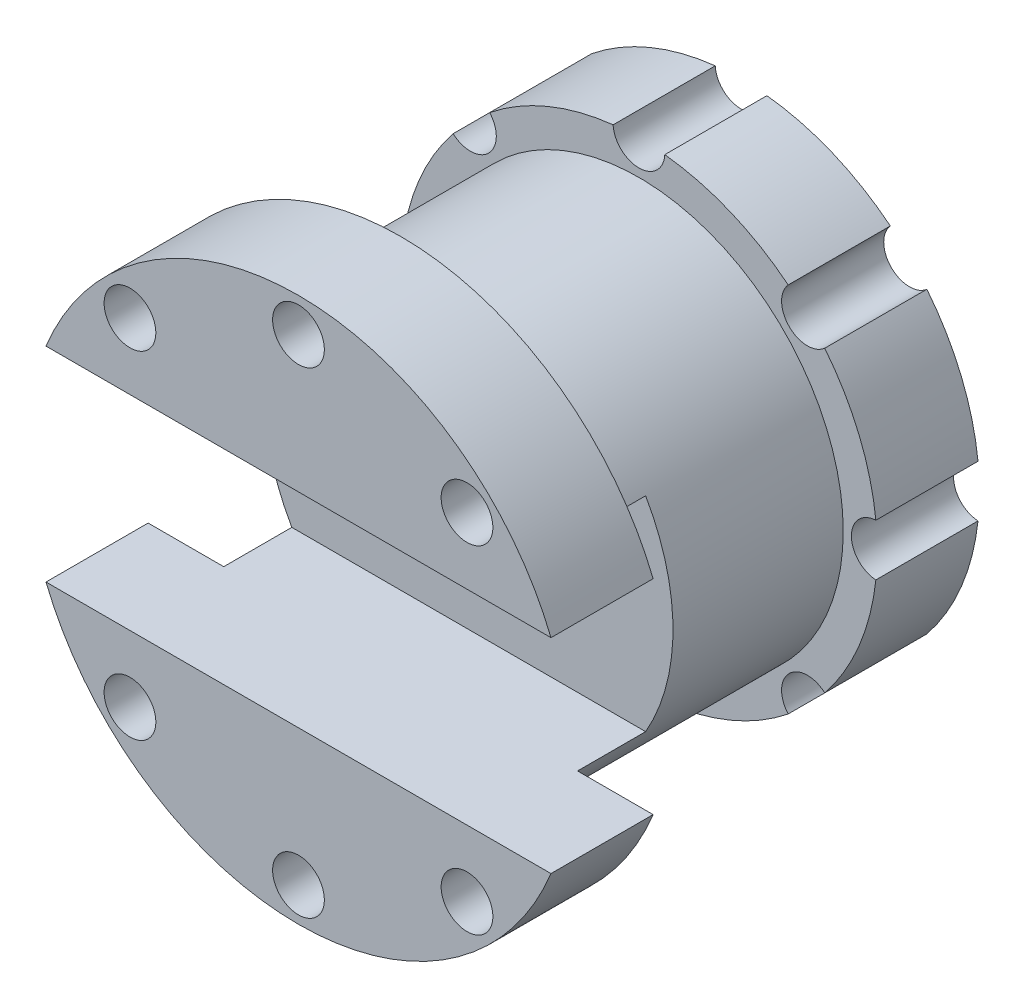
ISO-10303-21;
HEADER;
FILE_DESCRIPTION(('STEP AP214'),'2;1');
FILE_NAME('part.step','',(''),(''),'','','');
FILE_SCHEMA(('AUTOMOTIVE_DESIGN { 1 0 10303 214 1 1 1 1 }'));
ENDSEC;
DATA;
#1=APPLICATION_CONTEXT('core data for automotive mechanical design processes');
#2=APPLICATION_PROTOCOL_DEFINITION('international standard','automotive_design',2000,#1);
#3=PRODUCT_CONTEXT('',#1,'mechanical');
#4=PRODUCT('Part','Part','',(#3));
#5=PRODUCT_RELATED_PRODUCT_CATEGORY('part','',(#4));
#6=PRODUCT_DEFINITION_FORMATION('','',#4);
#7=PRODUCT_DEFINITION_CONTEXT('part definition',#1,'design');
#8=PRODUCT_DEFINITION('design','',#6,#7);
#9=PRODUCT_DEFINITION_SHAPE('','',#8);
#10=(LENGTH_UNIT() NAMED_UNIT(*) SI_UNIT(.MILLI.,.METRE.));
#11=(NAMED_UNIT(*) PLANE_ANGLE_UNIT() SI_UNIT($,.RADIAN.));
#12=(NAMED_UNIT(*) SI_UNIT($,.STERADIAN.) SOLID_ANGLE_UNIT());
#13=UNCERTAINTY_MEASURE_WITH_UNIT(LENGTH_MEASURE(1.E-05),#10,'distance_accuracy_value','');
#14=(GEOMETRIC_REPRESENTATION_CONTEXT(3) GLOBAL_UNCERTAINTY_ASSIGNED_CONTEXT((#13)) GLOBAL_UNIT_ASSIGNED_CONTEXT((#10,
#11,#12)) REPRESENTATION_CONTEXT('',''));
#15=CARTESIAN_POINT('',(0.,0.,0.));
#16=DIRECTION('',(0.,0.,1.));
#17=DIRECTION('',(1.,0.,0.));
#18=AXIS2_PLACEMENT_3D('',#15,#16,#17);
#19=CARTESIAN_POINT('',(0.,0.,63.5));
#20=DIRECTION('',(0.,0.,-1.));
#21=DIRECTION('',(-1.,0.,0.));
#22=AXIS2_PLACEMENT_3D('',#19,#20,#21);
#23=CYLINDRICAL_SURFACE('',#22,12.7);
#24=CARTESIAN_POINT('',(0.,0.,0.));
#25=DIRECTION('',(0.,0.,1.));
#26=DIRECTION('',(1.,0.,0.));
#27=AXIS2_PLACEMENT_3D('',#24,#25,#26);
#28=CIRCLE('',#27,12.7);
#29=CARTESIAN_POINT('',(12.7,0.,0.));
#30=VERTEX_POINT('',#29);
#31=EDGE_CURVE('E45',#30,#30,#28,.T.);
#32=ORIENTED_EDGE('',*,*,#31,.F.);
#33=EDGE_LOOP('',(#32));
#34=FACE_BOUND('',#33,.T.);
#35=CARTESIAN_POINT('',(0.,0.,50.8));
#36=DIRECTION('',(0.,0.,1.));
#37=DIRECTION('',(1.,0.,0.));
#38=AXIS2_PLACEMENT_3D('',#35,#36,#37);
#39=CIRCLE('',#38,12.7);
#40=CARTESIAN_POINT('',(12.7,0.,50.8));
#41=VERTEX_POINT('',#40);
#42=EDGE_CURVE('E498',#41,#41,#39,.F.);
#43=ORIENTED_EDGE('',*,*,#42,.F.);
#44=EDGE_LOOP('',(#43));
#45=FACE_BOUND('',#44,.T.);
#46=ADVANCED_FACE('F42',(#34,#45),#23,.F.);
#47=CARTESIAN_POINT('',(0.,0.,63.5));
#48=DIRECTION('',(0.,0.,-1.));
#49=DIRECTION('',(-1.,0.,0.));
#50=AXIS2_PLACEMENT_3D('',#47,#48,#49);
#51=CYLINDRICAL_SURFACE('',#50,38.1);
#52=CARTESIAN_POINT('',(0.,0.,19.05));
#53=DIRECTION('',(0.,0.,1.));
#54=DIRECTION('',(1.,0.,0.));
#55=AXIS2_PLACEMENT_3D('',#52,#53,#54);
#56=CIRCLE('',#55,38.1);
#57=CARTESIAN_POINT('',(38.1,0.,19.05));
#58=VERTEX_POINT('',#57);
#59=EDGE_CURVE('E194',#58,#58,#56,.T.);
#60=ORIENTED_EDGE('',*,*,#59,.T.);
#61=EDGE_LOOP('',(#60));
#62=FACE_BOUND('',#61,.T.);
#63=DIRECTION('',(0.,0.,1.));
#64=VECTOR('',#63,1.);
#65=CARTESIAN_POINT('',(-32.9955678841871,19.05,50.8));
#66=LINE('',#65,#64);
#67=CARTESIAN_POINT('',(-32.9955678841871,19.05,50.8));
#68=VERTEX_POINT('',#67);
#69=CARTESIAN_POINT('',(-32.9955678841871,19.05,63.5));
#70=VERTEX_POINT('',#69);
#71=EDGE_CURVE('E516',#68,#70,#66,.T.);
#72=ORIENTED_EDGE('',*,*,#71,.T.);
#73=CARTESIAN_POINT('',(0.,0.,63.5));
#74=DIRECTION('',(0.,0.,1.));
#75=DIRECTION('',(1.,0.,0.));
#76=AXIS2_PLACEMENT_3D('',#73,#74,#75);
#77=CIRCLE('',#76,38.1);
#78=CARTESIAN_POINT('',(32.9955678841871,19.05,63.5));
#79=VERTEX_POINT('',#78);
#80=EDGE_CURVE('E12',#79,#70,#77,.T.);
#81=ORIENTED_EDGE('',*,*,#80,.F.);
#82=DIRECTION('',(0.,0.,1.));
#83=VECTOR('',#82,1.);
#84=CARTESIAN_POINT('',(32.9955678841871,19.05,50.8));
#85=LINE('',#84,#83);
#86=CARTESIAN_POINT('',(32.9955678841871,19.05,50.8));
#87=VERTEX_POINT('',#86);
#88=EDGE_CURVE('E521',#87,#79,#85,.T.);
#89=ORIENTED_EDGE('',*,*,#88,.F.);
#90=CARTESIAN_POINT('',(0.,0.,50.8));
#91=DIRECTION('',(0.,0.,1.));
#92=DIRECTION('',(1.,0.,0.));
#93=AXIS2_PLACEMENT_3D('',#90,#91,#92);
#94=CIRCLE('',#93,38.1);
#95=CARTESIAN_POINT('',(32.9955678841871,-19.05,50.8));
#96=VERTEX_POINT('',#95);
#97=EDGE_CURVE('E507',#96,#87,#94,.T.);
#98=ORIENTED_EDGE('',*,*,#97,.F.);
#99=DIRECTION('',(0.,0.,1.));
#100=VECTOR('',#99,1.);
#101=CARTESIAN_POINT('',(32.9955678841871,-19.05,50.8));
#102=LINE('',#101,#100);
#103=CARTESIAN_POINT('',(32.9955678841871,-19.05,63.5));
#104=VERTEX_POINT('',#103);
#105=EDGE_CURVE('E316',#96,#104,#102,.T.);
#106=ORIENTED_EDGE('',*,*,#105,.T.);
#107=CARTESIAN_POINT('',(-32.9955678841871,-19.05,63.5));
#108=VERTEX_POINT('',#107);
#109=EDGE_CURVE('E52',#108,#104,#77,.T.);
#110=ORIENTED_EDGE('',*,*,#109,.F.);
#111=DIRECTION('',(0.,0.,1.));
#112=VECTOR('',#111,1.);
#113=CARTESIAN_POINT('',(-32.9955678841871,-19.05,50.8));
#114=LINE('',#113,#112);
#115=CARTESIAN_POINT('',(-32.9955678841871,-19.05,50.8));
#116=VERTEX_POINT('',#115);
#117=EDGE_CURVE('E515',#116,#108,#114,.T.);
#118=ORIENTED_EDGE('',*,*,#117,.F.);
#119=EDGE_CURVE('E501',#68,#116,#94,.T.);
#120=ORIENTED_EDGE('',*,*,#119,.F.);
#121=EDGE_LOOP('',(#72,#81,#89,#98,#106,#110,#118,#120));
#122=FACE_BOUND('',#121,.T.);
#123=ADVANCED_FACE('F486',(#62,#122),#51,.T.);
#124=CARTESIAN_POINT('',(0.,0.,0.));
#125=DIRECTION('',(0.,0.,1.));
#126=DIRECTION('',(1.,0.,0.));
#127=AXIS2_PLACEMENT_3D('',#124,#125,#126);
#128=PLANE('',#127);
#129=ORIENTED_EDGE('',*,*,#31,.T.);
#130=EDGE_LOOP('',(#129));
#131=FACE_BOUND('',#130,.T.);
#132=CARTESIAN_POINT('',(-31.4308964237409,31.4308964237394,0.));
#133=DIRECTION('',(0.,0.,1.));
#134=DIRECTION('',(1.,0.,0.));
#135=AXIS2_PLACEMENT_3D('',#132,#133,#134);
#136=CIRCLE('',#135,4.82600000000236);
#137=CARTESIAN_POINT('',(-34.6531119746391,27.8381811631637,0.));
#138=VERTEX_POINT('',#137);
#139=CARTESIAN_POINT('',(-27.8381811631655,34.6531119746377,0.));
#140=VERTEX_POINT('',#139);
#141=EDGE_CURVE('E202',#138,#140,#136,.T.);
#142=ORIENTED_EDGE('',*,*,#141,.T.);
#143=CARTESIAN_POINT('',(0.,0.,0.));
#144=DIRECTION('',(0.,0.,1.));
#145=DIRECTION('',(1.,0.,0.));
#146=AXIS2_PLACEMENT_3D('',#143,#144,#145);
#147=CIRCLE('',#146,44.45);
#148=CARTESIAN_POINT('',(-4.81888379010777,44.1880171428571,0.));
#149=VERTEX_POINT('',#148);
#150=EDGE_CURVE('E212',#149,#140,#147,.T.);
#151=ORIENTED_EDGE('',*,*,#150,.F.);
#152=CARTESIAN_POINT('',(0.,44.45,0.));
#153=DIRECTION('',(0.,0.,1.));
#154=DIRECTION('',(1.,0.,0.));
#155=AXIS2_PLACEMENT_3D('',#152,#153,#154);
#156=CIRCLE('',#155,4.826);
#157=CARTESIAN_POINT('',(4.81888379010777,44.1880171428571,0.));
#158=VERTEX_POINT('',#157);
#159=EDGE_CURVE('E241',#149,#158,#156,.T.);
#160=ORIENTED_EDGE('',*,*,#159,.T.);
#161=CARTESIAN_POINT('',(27.8381811631656,34.6531119746376,0.));
#162=VERTEX_POINT('',#161);
#163=EDGE_CURVE('E183',#162,#158,#147,.T.);
#164=ORIENTED_EDGE('',*,*,#163,.F.);
#165=CARTESIAN_POINT('',(31.4308964237431,31.4308964237447,0.));
#166=DIRECTION('',(0.,0.,1.));
#167=DIRECTION('',(1.,0.,0.));
#168=AXIS2_PLACEMENT_3D('',#165,#166,#167);
#169=CIRCLE('',#168,4.82600000000035);
#170=CARTESIAN_POINT('',(34.6531119746362,27.8381811631673,0.));
#171=VERTEX_POINT('',#170);
#172=EDGE_CURVE('E237',#162,#171,#169,.T.);
#173=ORIENTED_EDGE('',*,*,#172,.T.);
#174=CARTESIAN_POINT('',(44.1880171428565,4.81888379011393,0.));
#175=VERTEX_POINT('',#174);
#176=EDGE_CURVE('E236',#175,#171,#147,.T.);
#177=ORIENTED_EDGE('',*,*,#176,.F.);
#178=CARTESIAN_POINT('',(44.4500000000038,3.78186962001106E-12,0.));
#179=DIRECTION('',(0.,0.,1.));
#180=DIRECTION('',(1.,0.,0.));
#181=AXIS2_PLACEMENT_3D('',#178,#179,#180);
#182=CIRCLE('',#181,4.82600000000266);
#183=CARTESIAN_POINT('',(44.1880171428573,-4.81888379010641,0.));
#184=VERTEX_POINT('',#183);
#185=EDGE_CURVE('E232',#175,#184,#182,.T.);
#186=ORIENTED_EDGE('',*,*,#185,.T.);
#187=CARTESIAN_POINT('',(34.6531119746443,-27.8381811631572,0.));
#188=VERTEX_POINT('',#187);
#189=EDGE_CURVE('E231',#188,#184,#147,.T.);
#190=ORIENTED_EDGE('',*,*,#189,.F.);
#191=CARTESIAN_POINT('',(31.4308964237485,-31.4308964237394,0.));
#192=DIRECTION('',(0.,0.,1.));
#193=DIRECTION('',(1.,0.,0.));
#194=AXIS2_PLACEMENT_3D('',#191,#192,#193);
#195=CIRCLE('',#194,4.82600000000561);
#196=CARTESIAN_POINT('',(27.8381811631673,-34.6531119746362,0.));
#197=VERTEX_POINT('',#196);
#198=EDGE_CURVE('E227',#188,#197,#195,.T.);
#199=ORIENTED_EDGE('',*,*,#198,.T.);
#200=CARTESIAN_POINT('',(4.8188837901228,-44.1880171428555,0.));
#201=VERTEX_POINT('',#200);
#202=EDGE_CURVE('E226',#201,#197,#147,.T.);
#203=ORIENTED_EDGE('',*,*,#202,.F.);
#204=CARTESIAN_POINT('',(7.56373924002212E-12,-44.45,0.));
#205=DIRECTION('',(0.,0.,1.));
#206=DIRECTION('',(1.,0.,0.));
#207=AXIS2_PLACEMENT_3D('',#204,#205,#206);
#208=CIRCLE('',#207,4.82600000000753);
#209=CARTESIAN_POINT('',(-4.81888379010776,-44.1880171428571,0.));
#210=VERTEX_POINT('',#209);
#211=EDGE_CURVE('E222',#201,#210,#208,.T.);
#212=ORIENTED_EDGE('',*,*,#211,.T.);
#213=CARTESIAN_POINT('',(-27.8381811631557,-34.6531119746455,0.));
#214=VERTEX_POINT('',#213);
#215=EDGE_CURVE('E221',#214,#210,#147,.T.);
#216=ORIENTED_EDGE('',*,*,#215,.F.);
#217=CARTESIAN_POINT('',(-31.4308964237356,-31.4308964237447,0.));
#218=DIRECTION('',(0.,0.,1.));
#219=DIRECTION('',(1.,0.,0.));
#220=AXIS2_PLACEMENT_3D('',#217,#218,#219);
#221=CIRCLE('',#220,4.82600000000732);
#222=CARTESIAN_POINT('',(-34.6531119746374,-27.8381811631658,0.));
#223=VERTEX_POINT('',#222);
#224=EDGE_CURVE('E217',#214,#223,#221,.T.);
#225=ORIENTED_EDGE('',*,*,#224,.T.);
#226=CARTESIAN_POINT('',(-44.1880171428561,-4.81888379011688,0.));
#227=VERTEX_POINT('',#226);
#228=EDGE_CURVE('E213',#227,#223,#147,.T.);
#229=ORIENTED_EDGE('',*,*,#228,.F.);
#230=CARTESIAN_POINT('',(-44.4499999999962,-3.78731317503327E-12,0.));
#231=DIRECTION('',(0.,0.,1.));
#232=DIRECTION('',(1.,0.,0.));
#233=AXIS2_PLACEMENT_3D('',#230,#231,#232);
#234=CIRCLE('',#233,4.82600000000517);
#235=CARTESIAN_POINT('',(-44.188017142857,4.81888379010936,0.));
#236=VERTEX_POINT('',#235);
#237=EDGE_CURVE('E211',#227,#236,#234,.T.);
#238=ORIENTED_EDGE('',*,*,#237,.T.);
#239=EDGE_CURVE('E206',#138,#236,#147,.T.);
#240=ORIENTED_EDGE('',*,*,#239,.F.);
#241=EDGE_LOOP('',(#142,#151,#160,#164,#173,#177,#186,#190,#199,#203,#212,#216,#225,#229,#238,#240));
#242=FACE_BOUND('',#241,.T.);
#243=ADVANCED_FACE('F466',(#131,#242),#128,.F.);
#244=CARTESIAN_POINT('',(-31.4308964237409,31.4308964237394,19.05));
#245=DIRECTION('',(0.,0.,-1.));
#246=DIRECTION('',(-1.,0.,0.));
#247=AXIS2_PLACEMENT_3D('',#244,#245,#246);
#248=CYLINDRICAL_SURFACE('',#247,4.82600000000236);
#249=ORIENTED_EDGE('',*,*,#141,.F.);
#250=DIRECTION('',(0.,0.,-1.));
#251=VECTOR('',#250,1.);
#252=CARTESIAN_POINT('',(-34.6531119746391,27.8381811631637,19.05));
#253=LINE('',#252,#251);
#254=CARTESIAN_POINT('',(-34.6531119746391,27.8381811631637,19.05));
#255=VERTEX_POINT('',#254);
#256=EDGE_CURVE('E124',#255,#138,#253,.T.);
#257=ORIENTED_EDGE('',*,*,#256,.F.);
#258=CARTESIAN_POINT('',(-31.4308964237409,31.4308964237394,19.05));
#259=DIRECTION('',(0.,0.,1.));
#260=DIRECTION('',(1.,0.,0.));
#261=AXIS2_PLACEMENT_3D('',#258,#259,#260);
#262=CIRCLE('',#261,4.82600000000236);
#263=CARTESIAN_POINT('',(-27.8381811631655,34.6531119746377,19.05));
#264=VERTEX_POINT('',#263);
#265=EDGE_CURVE('E391',#255,#264,#262,.T.);
#266=ORIENTED_EDGE('',*,*,#265,.T.);
#267=DIRECTION('',(0.,0.,-1.));
#268=VECTOR('',#267,1.);
#269=CARTESIAN_POINT('',(-27.8381811631655,34.6531119746377,19.05));
#270=LINE('',#269,#268);
#271=EDGE_CURVE('E120',#264,#140,#270,.T.);
#272=ORIENTED_EDGE('',*,*,#271,.T.);
#273=EDGE_LOOP('',(#249,#257,#266,#272));
#274=FACE_BOUND('',#273,.T.);
#275=ADVANCED_FACE('F476',(#274),#248,.F.);
#276=CARTESIAN_POINT('',(0.,0.,19.05));
#277=DIRECTION('',(0.,0.,-1.));
#278=DIRECTION('',(-1.,0.,0.));
#279=AXIS2_PLACEMENT_3D('',#276,#277,#278);
#280=CYLINDRICAL_SURFACE('',#279,44.45);
#281=ORIENTED_EDGE('',*,*,#239,.T.);
#282=DIRECTION('',(0.,0.,-1.));
#283=VECTOR('',#282,1.);
#284=CARTESIAN_POINT('',(-44.188017142857,4.81888379010936,19.05));
#285=LINE('',#284,#283);
#286=CARTESIAN_POINT('',(-44.188017142857,4.81888379010936,19.05));
#287=VERTEX_POINT('',#286);
#288=EDGE_CURVE('E280',#287,#236,#285,.T.);
#289=ORIENTED_EDGE('',*,*,#288,.F.);
#290=CARTESIAN_POINT('',(0.,0.,19.05));
#291=DIRECTION('',(0.,0.,1.));
#292=DIRECTION('',(1.,0.,0.));
#293=AXIS2_PLACEMENT_3D('',#290,#291,#292);
#294=CIRCLE('',#293,44.45);
#295=EDGE_CURVE('E195',#255,#287,#294,.T.);
#296=ORIENTED_EDGE('',*,*,#295,.F.);
#297=ORIENTED_EDGE('',*,*,#256,.T.);
#298=EDGE_LOOP('',(#281,#289,#296,#297));
#299=FACE_BOUND('',#298,.T.);
#300=ADVANCED_FACE('F478',(#299),#280,.T.);
#301=CARTESIAN_POINT('',(-44.4499999999962,-3.78731317503327E-12,19.05));
#302=DIRECTION('',(0.,0.,-1.));
#303=DIRECTION('',(-1.,0.,0.));
#304=AXIS2_PLACEMENT_3D('',#301,#302,#303);
#305=CYLINDRICAL_SURFACE('',#304,4.82600000000517);
#306=ORIENTED_EDGE('',*,*,#237,.F.);
#307=DIRECTION('',(0.,0.,-1.));
#308=VECTOR('',#307,1.);
#309=CARTESIAN_POINT('',(-44.1880171428561,-4.81888379011688,19.05));
#310=LINE('',#309,#308);
#311=CARTESIAN_POINT('',(-44.1880171428561,-4.81888379011688,19.05));
#312=VERTEX_POINT('',#311);
#313=EDGE_CURVE('E277',#312,#227,#310,.T.);
#314=ORIENTED_EDGE('',*,*,#313,.F.);
#315=CARTESIAN_POINT('',(-44.4499999999962,-3.78731317503327E-12,19.05));
#316=DIRECTION('',(0.,0.,1.));
#317=DIRECTION('',(1.,0.,0.));
#318=AXIS2_PLACEMENT_3D('',#315,#316,#317);
#319=CIRCLE('',#318,4.82600000000517);
#320=EDGE_CURVE('E395',#312,#287,#319,.T.);
#321=ORIENTED_EDGE('',*,*,#320,.T.);
#322=ORIENTED_EDGE('',*,*,#288,.T.);
#323=EDGE_LOOP('',(#306,#314,#321,#322));
#324=FACE_BOUND('',#323,.T.);
#325=ADVANCED_FACE('F484',(#324),#305,.F.);
#326=ORIENTED_EDGE('',*,*,#228,.T.);
#327=DIRECTION('',(0.,0.,-1.));
#328=VECTOR('',#327,1.);
#329=CARTESIAN_POINT('',(-34.6531119746374,-27.8381811631658,19.05));
#330=LINE('',#329,#328);
#331=CARTESIAN_POINT('',(-34.6531119746374,-27.8381811631658,19.05));
#332=VERTEX_POINT('',#331);
#333=EDGE_CURVE('E274',#332,#223,#330,.T.);
#334=ORIENTED_EDGE('',*,*,#333,.F.);
#335=EDGE_CURVE('E396',#312,#332,#294,.T.);
#336=ORIENTED_EDGE('',*,*,#335,.F.);
#337=ORIENTED_EDGE('',*,*,#313,.T.);
#338=EDGE_LOOP('',(#326,#334,#336,#337));
#339=FACE_BOUND('',#338,.T.);
#340=ADVANCED_FACE('F438',(#339),#280,.T.);
#341=CARTESIAN_POINT('',(-31.4308964237356,-31.4308964237447,19.05));
#342=DIRECTION('',(0.,0.,-1.));
#343=DIRECTION('',(-1.,0.,0.));
#344=AXIS2_PLACEMENT_3D('',#341,#342,#343);
#345=CYLINDRICAL_SURFACE('',#344,4.82600000000732);
#346=ORIENTED_EDGE('',*,*,#224,.F.);
#347=DIRECTION('',(0.,0.,-1.));
#348=VECTOR('',#347,1.);
#349=CARTESIAN_POINT('',(-27.8381811631557,-34.6531119746455,19.05));
#350=LINE('',#349,#348);
#351=CARTESIAN_POINT('',(-27.8381811631557,-34.6531119746455,19.05));
#352=VERTEX_POINT('',#351);
#353=EDGE_CURVE('E271',#352,#214,#350,.T.);
#354=ORIENTED_EDGE('',*,*,#353,.F.);
#355=CARTESIAN_POINT('',(-31.4308964237356,-31.4308964237447,19.05));
#356=DIRECTION('',(0.,0.,1.));
#357=DIRECTION('',(1.,0.,0.));
#358=AXIS2_PLACEMENT_3D('',#355,#356,#357);
#359=CIRCLE('',#358,4.82600000000732);
#360=EDGE_CURVE('E400',#352,#332,#359,.T.);
#361=ORIENTED_EDGE('',*,*,#360,.T.);
#362=ORIENTED_EDGE('',*,*,#333,.T.);
#363=EDGE_LOOP('',(#346,#354,#361,#362));
#364=FACE_BOUND('',#363,.T.);
#365=ADVANCED_FACE('F442',(#364),#345,.F.);
#366=ORIENTED_EDGE('',*,*,#215,.T.);
#367=DIRECTION('',(0.,0.,-1.));
#368=VECTOR('',#367,1.);
#369=CARTESIAN_POINT('',(-4.81888379010776,-44.1880171428571,19.05));
#370=LINE('',#369,#368);
#371=CARTESIAN_POINT('',(-4.81888379010776,-44.1880171428571,19.05));
#372=VERTEX_POINT('',#371);
#373=EDGE_CURVE('E268',#372,#210,#370,.T.);
#374=ORIENTED_EDGE('',*,*,#373,.F.);
#375=EDGE_CURVE('E404',#352,#372,#294,.T.);
#376=ORIENTED_EDGE('',*,*,#375,.F.);
#377=ORIENTED_EDGE('',*,*,#353,.T.);
#378=EDGE_LOOP('',(#366,#374,#376,#377));
#379=FACE_BOUND('',#378,.T.);
#380=ADVANCED_FACE('F446',(#379),#280,.T.);
#381=CARTESIAN_POINT('',(7.56373924002212E-12,-44.45,19.05));
#382=DIRECTION('',(0.,0.,-1.));
#383=DIRECTION('',(-1.,0.,0.));
#384=AXIS2_PLACEMENT_3D('',#381,#382,#383);
#385=CYLINDRICAL_SURFACE('',#384,4.82600000000753);
#386=ORIENTED_EDGE('',*,*,#211,.F.);
#387=DIRECTION('',(0.,0.,-1.));
#388=VECTOR('',#387,1.);
#389=CARTESIAN_POINT('',(4.8188837901228,-44.1880171428555,19.05));
#390=LINE('',#389,#388);
#391=CARTESIAN_POINT('',(4.8188837901228,-44.1880171428555,19.05));
#392=VERTEX_POINT('',#391);
#393=EDGE_CURVE('E265',#392,#201,#390,.T.);
#394=ORIENTED_EDGE('',*,*,#393,.F.);
#395=CARTESIAN_POINT('',(7.56373924002212E-12,-44.45,19.05));
#396=DIRECTION('',(0.,0.,1.));
#397=DIRECTION('',(1.,0.,0.));
#398=AXIS2_PLACEMENT_3D('',#395,#396,#397);
#399=CIRCLE('',#398,4.82600000000753);
#400=EDGE_CURVE('E405',#392,#372,#399,.T.);
#401=ORIENTED_EDGE('',*,*,#400,.T.);
#402=ORIENTED_EDGE('',*,*,#373,.T.);
#403=EDGE_LOOP('',(#386,#394,#401,#402));
#404=FACE_BOUND('',#403,.T.);
#405=ADVANCED_FACE('F449',(#404),#385,.F.);
#406=ORIENTED_EDGE('',*,*,#202,.T.);
#407=DIRECTION('',(0.,0.,-1.));
#408=VECTOR('',#407,1.);
#409=CARTESIAN_POINT('',(27.8381811631673,-34.6531119746362,19.05));
#410=LINE('',#409,#408);
#411=CARTESIAN_POINT('',(27.8381811631673,-34.6531119746362,19.05));
#412=VERTEX_POINT('',#411);
#413=EDGE_CURVE('E262',#412,#197,#410,.T.);
#414=ORIENTED_EDGE('',*,*,#413,.F.);
#415=EDGE_CURVE('E409',#392,#412,#294,.T.);
#416=ORIENTED_EDGE('',*,*,#415,.F.);
#417=ORIENTED_EDGE('',*,*,#393,.T.);
#418=EDGE_LOOP('',(#406,#414,#416,#417));
#419=FACE_BOUND('',#418,.T.);
#420=ADVANCED_FACE('F453',(#419),#280,.T.);
#421=CARTESIAN_POINT('',(31.4308964237485,-31.4308964237394,19.05));
#422=DIRECTION('',(0.,0.,-1.));
#423=DIRECTION('',(-1.,0.,0.));
#424=AXIS2_PLACEMENT_3D('',#421,#422,#423);
#425=CYLINDRICAL_SURFACE('',#424,4.82600000000561);
#426=ORIENTED_EDGE('',*,*,#198,.F.);
#427=DIRECTION('',(0.,0.,-1.));
#428=VECTOR('',#427,1.);
#429=CARTESIAN_POINT('',(34.6531119746443,-27.8381811631572,19.05));
#430=LINE('',#429,#428);
#431=CARTESIAN_POINT('',(34.6531119746443,-27.8381811631572,19.05));
#432=VERTEX_POINT('',#431);
#433=EDGE_CURVE('E259',#432,#188,#430,.T.);
#434=ORIENTED_EDGE('',*,*,#433,.F.);
#435=CARTESIAN_POINT('',(31.4308964237485,-31.4308964237394,19.05));
#436=DIRECTION('',(0.,0.,1.));
#437=DIRECTION('',(1.,0.,0.));
#438=AXIS2_PLACEMENT_3D('',#435,#436,#437);
#439=CIRCLE('',#438,4.82600000000561);
#440=EDGE_CURVE('E410',#432,#412,#439,.T.);
#441=ORIENTED_EDGE('',*,*,#440,.T.);
#442=ORIENTED_EDGE('',*,*,#413,.T.);
#443=EDGE_LOOP('',(#426,#434,#441,#442));
#444=FACE_BOUND('',#443,.T.);
#445=ADVANCED_FACE('F456',(#444),#425,.F.);
#446=ORIENTED_EDGE('',*,*,#189,.T.);
#447=DIRECTION('',(0.,0.,-1.));
#448=VECTOR('',#447,1.);
#449=CARTESIAN_POINT('',(44.1880171428573,-4.81888379010641,19.05));
#450=LINE('',#449,#448);
#451=CARTESIAN_POINT('',(44.1880171428573,-4.81888379010641,19.05));
#452=VERTEX_POINT('',#451);
#453=EDGE_CURVE('E256',#452,#184,#450,.T.);
#454=ORIENTED_EDGE('',*,*,#453,.F.);
#455=EDGE_CURVE('E413',#432,#452,#294,.T.);
#456=ORIENTED_EDGE('',*,*,#455,.F.);
#457=ORIENTED_EDGE('',*,*,#433,.T.);
#458=EDGE_LOOP('',(#446,#454,#456,#457));
#459=FACE_BOUND('',#458,.T.);
#460=ADVANCED_FACE('F460',(#459),#280,.T.);
#461=CARTESIAN_POINT('',(44.4500000000038,3.78186962001106E-12,19.05));
#462=DIRECTION('',(0.,0.,-1.));
#463=DIRECTION('',(-1.,0.,0.));
#464=AXIS2_PLACEMENT_3D('',#461,#462,#463);
#465=CYLINDRICAL_SURFACE('',#464,4.82600000000266);
#466=ORIENTED_EDGE('',*,*,#185,.F.);
#467=DIRECTION('',(0.,0.,-1.));
#468=VECTOR('',#467,1.);
#469=CARTESIAN_POINT('',(44.1880171428565,4.81888379011393,19.05));
#470=LINE('',#469,#468);
#471=CARTESIAN_POINT('',(44.1880171428565,4.81888379011393,19.05));
#472=VERTEX_POINT('',#471);
#473=EDGE_CURVE('E253',#472,#175,#470,.T.);
#474=ORIENTED_EDGE('',*,*,#473,.F.);
#475=CARTESIAN_POINT('',(44.4500000000038,3.78186962001106E-12,19.05));
#476=DIRECTION('',(0.,0.,1.));
#477=DIRECTION('',(1.,0.,0.));
#478=AXIS2_PLACEMENT_3D('',#475,#476,#477);
#479=CIRCLE('',#478,4.82600000000266);
#480=EDGE_CURVE('E414',#472,#452,#479,.T.);
#481=ORIENTED_EDGE('',*,*,#480,.T.);
#482=ORIENTED_EDGE('',*,*,#453,.T.);
#483=EDGE_LOOP('',(#466,#474,#481,#482));
#484=FACE_BOUND('',#483,.T.);
#485=ADVANCED_FACE('F462',(#484),#465,.F.);
#486=ORIENTED_EDGE('',*,*,#176,.T.);
#487=DIRECTION('',(0.,0.,-1.));
#488=VECTOR('',#487,1.);
#489=CARTESIAN_POINT('',(34.6531119746362,27.8381811631673,19.05));
#490=LINE('',#489,#488);
#491=CARTESIAN_POINT('',(34.6531119746362,27.8381811631673,19.05));
#492=VERTEX_POINT('',#491);
#493=EDGE_CURVE('E250',#492,#171,#490,.T.);
#494=ORIENTED_EDGE('',*,*,#493,.F.);
#495=EDGE_CURVE('E178',#472,#492,#294,.T.);
#496=ORIENTED_EDGE('',*,*,#495,.F.);
#497=ORIENTED_EDGE('',*,*,#473,.T.);
#498=EDGE_LOOP('',(#486,#494,#496,#497));
#499=FACE_BOUND('',#498,.T.);
#500=ADVANCED_FACE('F608',(#499),#280,.T.);
#501=CARTESIAN_POINT('',(31.4308964237431,31.4308964237447,19.05));
#502=DIRECTION('',(0.,0.,-1.));
#503=DIRECTION('',(-1.,0.,0.));
#504=AXIS2_PLACEMENT_3D('',#501,#502,#503);
#505=CYLINDRICAL_SURFACE('',#504,4.82600000000035);
#506=ORIENTED_EDGE('',*,*,#172,.F.);
#507=DIRECTION('',(0.,0.,-1.));
#508=VECTOR('',#507,1.);
#509=CARTESIAN_POINT('',(27.8381811631656,34.6531119746376,19.05));
#510=LINE('',#509,#508);
#511=CARTESIAN_POINT('',(27.8381811631656,34.6531119746376,19.05));
#512=VERTEX_POINT('',#511);
#513=EDGE_CURVE('E188',#512,#162,#510,.T.);
#514=ORIENTED_EDGE('',*,*,#513,.F.);
#515=CARTESIAN_POINT('',(31.4308964237431,31.4308964237447,19.05));
#516=DIRECTION('',(0.,0.,1.));
#517=DIRECTION('',(1.,0.,0.));
#518=AXIS2_PLACEMENT_3D('',#515,#516,#517);
#519=CIRCLE('',#518,4.82600000000035);
#520=EDGE_CURVE('E174',#512,#492,#519,.T.);
#521=ORIENTED_EDGE('',*,*,#520,.T.);
#522=ORIENTED_EDGE('',*,*,#493,.T.);
#523=EDGE_LOOP('',(#506,#514,#521,#522));
#524=FACE_BOUND('',#523,.T.);
#525=ADVANCED_FACE('F605',(#524),#505,.F.);
#526=ORIENTED_EDGE('',*,*,#163,.T.);
#527=DIRECTION('',(0.,0.,-1.));
#528=VECTOR('',#527,1.);
#529=CARTESIAN_POINT('',(4.81888379010777,44.1880171428571,19.05));
#530=LINE('',#529,#528);
#531=CARTESIAN_POINT('',(4.81888379010777,44.1880171428571,19.05));
#532=VERTEX_POINT('',#531);
#533=EDGE_CURVE('E180',#532,#158,#530,.T.);
#534=ORIENTED_EDGE('',*,*,#533,.F.);
#535=EDGE_CURVE('E167',#512,#532,#294,.T.);
#536=ORIENTED_EDGE('',*,*,#535,.F.);
#537=ORIENTED_EDGE('',*,*,#513,.T.);
#538=EDGE_LOOP('',(#526,#534,#536,#537));
#539=FACE_BOUND('',#538,.T.);
#540=ADVANCED_FACE('F181',(#539),#280,.T.);
#541=CARTESIAN_POINT('',(0.,44.45,19.05));
#542=DIRECTION('',(0.,0.,-1.));
#543=DIRECTION('',(-1.,0.,0.));
#544=AXIS2_PLACEMENT_3D('',#541,#542,#543);
#545=CYLINDRICAL_SURFACE('',#544,4.826);
#546=ORIENTED_EDGE('',*,*,#159,.F.);
#547=DIRECTION('',(0.,0.,-1.));
#548=VECTOR('',#547,1.);
#549=CARTESIAN_POINT('',(-4.81888379010777,44.1880171428571,19.05));
#550=LINE('',#549,#548);
#551=CARTESIAN_POINT('',(-4.81888379010777,44.1880171428571,19.05));
#552=VERTEX_POINT('',#551);
#553=EDGE_CURVE('E113',#552,#149,#550,.T.);
#554=ORIENTED_EDGE('',*,*,#553,.F.);
#555=CARTESIAN_POINT('',(0.,44.45,19.05));
#556=DIRECTION('',(0.,0.,1.));
#557=DIRECTION('',(1.,0.,0.));
#558=AXIS2_PLACEMENT_3D('',#555,#556,#557);
#559=CIRCLE('',#558,4.826);
#560=EDGE_CURVE('E172',#552,#532,#559,.T.);
#561=ORIENTED_EDGE('',*,*,#560,.T.);
#562=ORIENTED_EDGE('',*,*,#533,.T.);
#563=EDGE_LOOP('',(#546,#554,#561,#562));
#564=FACE_BOUND('',#563,.T.);
#565=ADVANCED_FACE('F190',(#564),#545,.F.);
#566=ORIENTED_EDGE('',*,*,#150,.T.);
#567=ORIENTED_EDGE('',*,*,#271,.F.);
#568=EDGE_CURVE('E60',#552,#264,#294,.T.);
#569=ORIENTED_EDGE('',*,*,#568,.F.);
#570=ORIENTED_EDGE('',*,*,#553,.T.);
#571=EDGE_LOOP('',(#566,#567,#569,#570));
#572=FACE_BOUND('',#571,.T.);
#573=ADVANCED_FACE('F475',(#572),#280,.T.);
#574=CARTESIAN_POINT('',(0.,0.,19.05));
#575=DIRECTION('',(0.,0.,1.));
#576=DIRECTION('',(1.,0.,0.));
#577=AXIS2_PLACEMENT_3D('',#574,#575,#576);
#578=PLANE('',#577);
#579=ORIENTED_EDGE('',*,*,#265,.F.);
#580=ORIENTED_EDGE('',*,*,#295,.T.);
#581=ORIENTED_EDGE('',*,*,#320,.F.);
#582=ORIENTED_EDGE('',*,*,#335,.T.);
#583=ORIENTED_EDGE('',*,*,#360,.F.);
#584=ORIENTED_EDGE('',*,*,#375,.T.);
#585=ORIENTED_EDGE('',*,*,#400,.F.);
#586=ORIENTED_EDGE('',*,*,#415,.T.);
#587=ORIENTED_EDGE('',*,*,#440,.F.);
#588=ORIENTED_EDGE('',*,*,#455,.T.);
#589=ORIENTED_EDGE('',*,*,#480,.F.);
#590=ORIENTED_EDGE('',*,*,#495,.T.);
#591=ORIENTED_EDGE('',*,*,#520,.F.);
#592=ORIENTED_EDGE('',*,*,#535,.T.);
#593=ORIENTED_EDGE('',*,*,#560,.F.);
#594=ORIENTED_EDGE('',*,*,#568,.T.);
#595=EDGE_LOOP('',(#579,#580,#581,#582,#583,#584,#585,#586,#587,#588,#589,#590,#591,#592,#593,#594));
#596=FACE_BOUND('',#595,.T.);
#597=ORIENTED_EDGE('',*,*,#59,.F.);
#598=EDGE_LOOP('',(#597));
#599=FACE_BOUND('',#598,.T.);
#600=ADVANCED_FACE('F169',(#596,#599),#578,.T.);
#601=CARTESIAN_POINT('',(0.,0.,63.5));
#602=DIRECTION('',(0.,0.,1.));
#603=DIRECTION('',(1.,0.,0.));
#604=AXIS2_PLACEMENT_3D('',#601,#602,#603);
#605=PLANE('',#604);
#606=CARTESIAN_POINT('',(-31.4308964237409,31.4308964237394,63.5));
#607=DIRECTION('',(0.,0.,1.));
#608=DIRECTION('',(1.,0.,0.));
#609=AXIS2_PLACEMENT_3D('',#606,#607,#608);
#610=CIRCLE('',#609,4.82600000000236);
#611=CARTESIAN_POINT('',(-26.6048964237386,31.4308964237394,63.5));
#612=VERTEX_POINT('',#611);
#613=EDGE_CURVE('E343',#612,#612,#610,.T.);
#614=ORIENTED_EDGE('',*,*,#613,.T.);
#615=EDGE_LOOP('',(#614));
#616=FACE_BOUND('',#615,.T.);
#617=CARTESIAN_POINT('',(31.4308964237431,31.4308964237447,63.5));
#618=DIRECTION('',(0.,0.,1.));
#619=DIRECTION('',(1.,0.,0.));
#620=AXIS2_PLACEMENT_3D('',#617,#618,#619);
#621=CIRCLE('',#620,4.82600000000035);
#622=CARTESIAN_POINT('',(36.2568964237435,31.4308964237447,63.5));
#623=VERTEX_POINT('',#622);
#624=EDGE_CURVE('E369',#623,#623,#621,.T.);
#625=ORIENTED_EDGE('',*,*,#624,.T.);
#626=EDGE_LOOP('',(#625));
#627=FACE_BOUND('',#626,.T.);
#628=CARTESIAN_POINT('',(0.,44.45,63.5));
#629=DIRECTION('',(0.,0.,1.));
#630=DIRECTION('',(1.,0.,0.));
#631=AXIS2_PLACEMENT_3D('',#628,#629,#630);
#632=CIRCLE('',#631,4.826);
#633=CARTESIAN_POINT('',(4.826,44.45,63.5));
#634=VERTEX_POINT('',#633);
#635=EDGE_CURVE('E373',#634,#634,#632,.T.);
#636=ORIENTED_EDGE('',*,*,#635,.T.);
#637=EDGE_LOOP('',(#636));
#638=FACE_BOUND('',#637,.T.);
#639=DIRECTION('',(1.,0.,0.));
#640=VECTOR('',#639,1.);
#641=CARTESIAN_POINT('',(0.,19.05,63.5));
#642=LINE('',#641,#640);
#643=CARTESIAN_POINT('',(47.0928603930575,19.05,63.5));
#644=VERTEX_POINT('',#643);
#645=EDGE_CURVE('E377',#79,#644,#642,.T.);
#646=ORIENTED_EDGE('',*,*,#645,.F.);
#647=ORIENTED_EDGE('',*,*,#80,.T.);
#648=CARTESIAN_POINT('',(-47.0928603930575,19.05,63.5));
#649=VERTEX_POINT('',#648);
#650=EDGE_CURVE('E378',#649,#70,#642,.T.);
#651=ORIENTED_EDGE('',*,*,#650,.F.);
#652=CARTESIAN_POINT('',(0.,0.,63.5));
#653=DIRECTION('',(0.,0.,1.));
#654=DIRECTION('',(1.,0.,0.));
#655=AXIS2_PLACEMENT_3D('',#652,#653,#654);
#656=CIRCLE('',#655,50.8);
#657=EDGE_CURVE('E349',#644,#649,#656,.T.);
#658=ORIENTED_EDGE('',*,*,#657,.F.);
#659=EDGE_LOOP('',(#646,#647,#651,#658));
#660=FACE_BOUND('',#659,.T.);
#661=ADVANCED_FACE('F577',(#616,#627,#638,#660),#605,.F.);
#662=CARTESIAN_POINT('',(0.,19.05,82.55));
#663=DIRECTION('',(0.,1.,0.));
#664=DIRECTION('',(0.,0.,1.));
#665=AXIS2_PLACEMENT_3D('',#662,#663,#664);
#666=PLANE('',#665);
#667=ORIENTED_EDGE('',*,*,#650,.T.);
#668=ORIENTED_EDGE('',*,*,#71,.F.);
#669=DIRECTION('',(1.,0.,0.));
#670=VECTOR('',#669,1.);
#671=CARTESIAN_POINT('',(0.,19.05,50.8));
#672=LINE('',#671,#670);
#673=EDGE_CURVE('E511',#68,#87,#672,.T.);
#674=ORIENTED_EDGE('',*,*,#673,.T.);
#675=ORIENTED_EDGE('',*,*,#88,.T.);
#676=ORIENTED_EDGE('',*,*,#645,.T.);
#677=DIRECTION('',(0.,0.,-1.));
#678=VECTOR('',#677,1.);
#679=CARTESIAN_POINT('',(47.0928603930575,19.05,82.55));
#680=LINE('',#679,#678);
#681=CARTESIAN_POINT('',(47.0928603930575,19.05,82.55));
#682=VERTEX_POINT('',#681);
#683=EDGE_CURVE('E207',#682,#644,#680,.T.);
#684=ORIENTED_EDGE('',*,*,#683,.F.);
#685=DIRECTION('',(1.,0.,0.));
#686=VECTOR('',#685,1.);
#687=CARTESIAN_POINT('',(0.,19.05,82.55));
#688=LINE('',#687,#686);
#689=CARTESIAN_POINT('',(-47.0928603930575,19.05,82.55));
#690=VERTEX_POINT('',#689);
#691=EDGE_CURVE('E357',#690,#682,#688,.T.);
#692=ORIENTED_EDGE('',*,*,#691,.F.);
#693=DIRECTION('',(0.,0.,-1.));
#694=VECTOR('',#693,1.);
#695=CARTESIAN_POINT('',(-47.0928603930575,19.05,82.55));
#696=LINE('',#695,#694);
#697=EDGE_CURVE('E365',#690,#649,#696,.T.);
#698=ORIENTED_EDGE('',*,*,#697,.T.);
#699=EDGE_LOOP('',(#667,#668,#674,#675,#676,#684,#692,#698));
#700=FACE_BOUND('',#699,.T.);
#701=ADVANCED_FACE('F580',(#700),#666,.F.);
#702=CARTESIAN_POINT('',(0.,44.45,82.55));
#703=DIRECTION('',(0.,0.,-1.));
#704=DIRECTION('',(-1.,0.,0.));
#705=AXIS2_PLACEMENT_3D('',#702,#703,#704);
#706=CYLINDRICAL_SURFACE('',#705,4.826);
#707=CARTESIAN_POINT('',(0.,44.45,82.55));
#708=DIRECTION('',(0.,0.,1.));
#709=DIRECTION('',(1.,0.,0.));
#710=AXIS2_PLACEMENT_3D('',#707,#708,#709);
#711=CIRCLE('',#710,4.826);
#712=CARTESIAN_POINT('',(4.826,44.45,82.55));
#713=VERTEX_POINT('',#712);
#714=EDGE_CURVE('E353',#713,#713,#711,.T.);
#715=ORIENTED_EDGE('',*,*,#714,.T.);
#716=EDGE_LOOP('',(#715));
#717=FACE_BOUND('',#716,.T.);
#718=ORIENTED_EDGE('',*,*,#635,.F.);
#719=EDGE_LOOP('',(#718));
#720=FACE_BOUND('',#719,.T.);
#721=ADVANCED_FACE('F588',(#717,#720),#706,.F.);
#722=CARTESIAN_POINT('',(31.4308964237431,31.4308964237447,82.55));
#723=DIRECTION('',(0.,0.,-1.));
#724=DIRECTION('',(-1.,0.,0.));
#725=AXIS2_PLACEMENT_3D('',#722,#723,#724);
#726=CYLINDRICAL_SURFACE('',#725,4.82600000000035);
#727=CARTESIAN_POINT('',(31.4308964237431,31.4308964237447,82.55));
#728=DIRECTION('',(0.,0.,1.));
#729=DIRECTION('',(1.,0.,0.));
#730=AXIS2_PLACEMENT_3D('',#727,#728,#729);
#731=CIRCLE('',#730,4.82600000000035);
#732=CARTESIAN_POINT('',(36.2568964237435,31.4308964237447,82.55));
#733=VERTEX_POINT('',#732);
#734=EDGE_CURVE('E348',#733,#733,#731,.T.);
#735=ORIENTED_EDGE('',*,*,#734,.T.);
#736=EDGE_LOOP('',(#735));
#737=FACE_BOUND('',#736,.T.);
#738=ORIENTED_EDGE('',*,*,#624,.F.);
#739=EDGE_LOOP('',(#738));
#740=FACE_BOUND('',#739,.T.);
#741=ADVANCED_FACE('F592',(#737,#740),#726,.F.);
#742=CARTESIAN_POINT('',(-31.4308964237409,31.4308964237394,82.55));
#743=DIRECTION('',(0.,0.,-1.));
#744=DIRECTION('',(-1.,0.,0.));
#745=AXIS2_PLACEMENT_3D('',#742,#743,#744);
#746=CYLINDRICAL_SURFACE('',#745,4.82600000000236);
#747=CARTESIAN_POINT('',(-31.4308964237409,31.4308964237394,82.55));
#748=DIRECTION('',(0.,0.,1.));
#749=DIRECTION('',(1.,0.,0.));
#750=AXIS2_PLACEMENT_3D('',#747,#748,#749);
#751=CIRCLE('',#750,4.82600000000236);
#752=CARTESIAN_POINT('',(-26.6048964237386,31.4308964237394,82.55));
#753=VERTEX_POINT('',#752);
#754=EDGE_CURVE('E344',#753,#753,#751,.T.);
#755=ORIENTED_EDGE('',*,*,#754,.T.);
#756=EDGE_LOOP('',(#755));
#757=FACE_BOUND('',#756,.T.);
#758=ORIENTED_EDGE('',*,*,#613,.F.);
#759=EDGE_LOOP('',(#758));
#760=FACE_BOUND('',#759,.T.);
#761=ADVANCED_FACE('F584',(#757,#760),#746,.F.);
#762=CARTESIAN_POINT('',(0.,0.,82.55));
#763=DIRECTION('',(0.,0.,-1.));
#764=DIRECTION('',(-1.,0.,0.));
#765=AXIS2_PLACEMENT_3D('',#762,#763,#764);
#766=CYLINDRICAL_SURFACE('',#765,50.8);
#767=ORIENTED_EDGE('',*,*,#657,.T.);
#768=ORIENTED_EDGE('',*,*,#697,.F.);
#769=CARTESIAN_POINT('',(0.,0.,82.55));
#770=DIRECTION('',(0.,0.,1.));
#771=DIRECTION('',(1.,0.,0.));
#772=AXIS2_PLACEMENT_3D('',#769,#770,#771);
#773=CIRCLE('',#772,50.8);
#774=EDGE_CURVE('E361',#682,#690,#773,.T.);
#775=ORIENTED_EDGE('',*,*,#774,.F.);
#776=ORIENTED_EDGE('',*,*,#683,.T.);
#777=EDGE_LOOP('',(#767,#768,#775,#776));
#778=FACE_BOUND('',#777,.T.);
#779=ADVANCED_FACE('F575',(#778),#766,.T.);
#780=CARTESIAN_POINT('',(0.,0.,82.55));
#781=DIRECTION('',(0.,0.,1.));
#782=DIRECTION('',(1.,0.,0.));
#783=AXIS2_PLACEMENT_3D('',#780,#781,#782);
#784=PLANE('',#783);
#785=ORIENTED_EDGE('',*,*,#754,.F.);
#786=EDGE_LOOP('',(#785));
#787=FACE_BOUND('',#786,.T.);
#788=ORIENTED_EDGE('',*,*,#734,.F.);
#789=EDGE_LOOP('',(#788));
#790=FACE_BOUND('',#789,.T.);
#791=ORIENTED_EDGE('',*,*,#714,.F.);
#792=EDGE_LOOP('',(#791));
#793=FACE_BOUND('',#792,.T.);
#794=ORIENTED_EDGE('',*,*,#691,.T.);
#795=ORIENTED_EDGE('',*,*,#774,.T.);
#796=EDGE_LOOP('',(#794,#795));
#797=FACE_BOUND('',#796,.T.);
#798=ADVANCED_FACE('F572',(#787,#790,#793,#797),#784,.T.);
#799=CARTESIAN_POINT('',(0.,-19.05,82.55));
#800=DIRECTION('',(0.,1.,0.));
#801=DIRECTION('',(0.,0.,1.));
#802=AXIS2_PLACEMENT_3D('',#799,#800,#801);
#803=PLANE('',#802);
#804=DIRECTION('',(1.,0.,0.));
#805=VECTOR('',#804,1.);
#806=CARTESIAN_POINT('',(0.,-19.05,63.5));
#807=LINE('',#806,#805);
#808=CARTESIAN_POINT('',(-47.0928603930575,-19.05,63.5));
#809=VERTEX_POINT('',#808);
#810=EDGE_CURVE('E305',#809,#108,#807,.T.);
#811=ORIENTED_EDGE('',*,*,#810,.F.);
#812=DIRECTION('',(0.,0.,-1.));
#813=VECTOR('',#812,1.);
#814=CARTESIAN_POINT('',(-47.0928603930575,-19.05,82.55));
#815=LINE('',#814,#813);
#816=CARTESIAN_POINT('',(-47.0928603930575,-19.05,82.55));
#817=VERTEX_POINT('',#816);
#818=EDGE_CURVE('E338',#817,#809,#815,.T.);
#819=ORIENTED_EDGE('',*,*,#818,.F.);
#820=DIRECTION('',(1.,0.,0.));
#821=VECTOR('',#820,1.);
#822=CARTESIAN_POINT('',(0.,-19.05,82.55));
#823=LINE('',#822,#821);
#824=CARTESIAN_POINT('',(47.0928603930575,-19.05,82.55));
#825=VERTEX_POINT('',#824);
#826=EDGE_CURVE('E541',#817,#825,#823,.T.);
#827=ORIENTED_EDGE('',*,*,#826,.T.);
#828=DIRECTION('',(0.,0.,-1.));
#829=VECTOR('',#828,1.);
#830=CARTESIAN_POINT('',(47.0928603930575,-19.05,82.55));
#831=LINE('',#830,#829);
#832=CARTESIAN_POINT('',(47.0928603930575,-19.05,63.5));
#833=VERTEX_POINT('',#832);
#834=EDGE_CURVE('E320',#825,#833,#831,.T.);
#835=ORIENTED_EDGE('',*,*,#834,.T.);
#836=EDGE_CURVE('E301',#104,#833,#807,.T.);
#837=ORIENTED_EDGE('',*,*,#836,.F.);
#838=ORIENTED_EDGE('',*,*,#105,.F.);
#839=DIRECTION('',(1.,0.,0.));
#840=VECTOR('',#839,1.);
#841=CARTESIAN_POINT('',(0.,-19.05,50.8));
#842=LINE('',#841,#840);
#843=EDGE_CURVE('E505',#116,#96,#842,.T.);
#844=ORIENTED_EDGE('',*,*,#843,.F.);
#845=ORIENTED_EDGE('',*,*,#117,.T.);
#846=EDGE_LOOP('',(#811,#819,#827,#835,#837,#838,#844,#845));
#847=FACE_BOUND('',#846,.T.);
#848=ADVANCED_FACE('F313',(#847),#803,.T.);
#849=CARTESIAN_POINT('',(31.4308964237485,-31.4308964237394,82.55));
#850=DIRECTION('',(0.,0.,-1.));
#851=DIRECTION('',(-1.,0.,0.));
#852=AXIS2_PLACEMENT_3D('',#849,#850,#851);
#853=CYLINDRICAL_SURFACE('',#852,4.82600000000561);
#854=CARTESIAN_POINT('',(31.4308964237485,-31.4308964237394,82.55));
#855=DIRECTION('',(0.,0.,1.));
#856=DIRECTION('',(1.,0.,0.));
#857=AXIS2_PLACEMENT_3D('',#854,#855,#856);
#858=CIRCLE('',#857,4.82600000000561);
#859=CARTESIAN_POINT('',(36.2568964237541,-31.4308964237394,82.55));
#860=VERTEX_POINT('',#859);
#861=EDGE_CURVE('E537',#860,#860,#858,.T.);
#862=ORIENTED_EDGE('',*,*,#861,.T.);
#863=EDGE_LOOP('',(#862));
#864=FACE_BOUND('',#863,.T.);
#865=CARTESIAN_POINT('',(31.4308964237485,-31.4308964237394,63.5));
#866=DIRECTION('',(0.,0.,1.));
#867=DIRECTION('',(1.,0.,0.));
#868=AXIS2_PLACEMENT_3D('',#865,#866,#867);
#869=CIRCLE('',#868,4.82600000000561);
#870=CARTESIAN_POINT('',(36.2568964237541,-31.4308964237394,63.5));
#871=VERTEX_POINT('',#870);
#872=EDGE_CURVE('E323',#871,#871,#869,.T.);
#873=ORIENTED_EDGE('',*,*,#872,.F.);
#874=EDGE_LOOP('',(#873));
#875=FACE_BOUND('',#874,.T.);
#876=ADVANCED_FACE('F558',(#864,#875),#853,.F.);
#877=CARTESIAN_POINT('',(7.56373924002212E-12,-44.45,82.55));
#878=DIRECTION('',(0.,0.,-1.));
#879=DIRECTION('',(-1.,0.,0.));
#880=AXIS2_PLACEMENT_3D('',#877,#878,#879);
#881=CYLINDRICAL_SURFACE('',#880,4.82600000000753);
#882=CARTESIAN_POINT('',(7.56373924002212E-12,-44.45,82.55));
#883=DIRECTION('',(0.,0.,1.));
#884=DIRECTION('',(1.,0.,0.));
#885=AXIS2_PLACEMENT_3D('',#882,#883,#884);
#886=CIRCLE('',#885,4.82600000000753);
#887=CARTESIAN_POINT('',(4.82600000001509,-44.45,82.55));
#888=VERTEX_POINT('',#887);
#889=EDGE_CURVE('E533',#888,#888,#886,.T.);
#890=ORIENTED_EDGE('',*,*,#889,.T.);
#891=EDGE_LOOP('',(#890));
#892=FACE_BOUND('',#891,.T.);
#893=CARTESIAN_POINT('',(7.56373924002212E-12,-44.45,63.5));
#894=DIRECTION('',(0.,0.,1.));
#895=DIRECTION('',(1.,0.,0.));
#896=AXIS2_PLACEMENT_3D('',#893,#894,#895);
#897=CIRCLE('',#896,4.82600000000753);
#898=CARTESIAN_POINT('',(4.82600000001509,-44.45,63.5));
#899=VERTEX_POINT('',#898);
#900=EDGE_CURVE('E329',#899,#899,#897,.T.);
#901=ORIENTED_EDGE('',*,*,#900,.F.);
#902=EDGE_LOOP('',(#901));
#903=FACE_BOUND('',#902,.T.);
#904=ADVANCED_FACE('F555',(#892,#903),#881,.F.);
#905=CARTESIAN_POINT('',(-31.4308964237356,-31.4308964237447,82.55));
#906=DIRECTION('',(0.,0.,-1.));
#907=DIRECTION('',(-1.,0.,0.));
#908=AXIS2_PLACEMENT_3D('',#905,#906,#907);
#909=CYLINDRICAL_SURFACE('',#908,4.82600000000732);
#910=CARTESIAN_POINT('',(-31.4308964237356,-31.4308964237447,82.55));
#911=DIRECTION('',(0.,0.,1.));
#912=DIRECTION('',(1.,0.,0.));
#913=AXIS2_PLACEMENT_3D('',#910,#911,#912);
#914=CIRCLE('',#913,4.82600000000732);
#915=CARTESIAN_POINT('',(-26.6048964237283,-31.4308964237447,82.55));
#916=VERTEX_POINT('',#915);
#917=EDGE_CURVE('E335',#916,#916,#914,.T.);
#918=ORIENTED_EDGE('',*,*,#917,.T.);
#919=EDGE_LOOP('',(#918));
#920=FACE_BOUND('',#919,.T.);
#921=CARTESIAN_POINT('',(-31.4308964237356,-31.4308964237447,63.5));
#922=DIRECTION('',(0.,0.,1.));
#923=DIRECTION('',(1.,0.,0.));
#924=AXIS2_PLACEMENT_3D('',#921,#922,#923);
#925=CIRCLE('',#924,4.82600000000732);
#926=CARTESIAN_POINT('',(-26.6048964237283,-31.4308964237447,63.5));
#927=VERTEX_POINT('',#926);
#928=EDGE_CURVE('E520',#927,#927,#925,.T.);
#929=ORIENTED_EDGE('',*,*,#928,.F.);
#930=EDGE_LOOP('',(#929));
#931=FACE_BOUND('',#930,.T.);
#932=ADVANCED_FACE('F557',(#920,#931),#909,.F.);
#933=CARTESIAN_POINT('',(0.,0.,82.55));
#934=DIRECTION('',(0.,0.,-1.));
#935=DIRECTION('',(-1.,0.,0.));
#936=AXIS2_PLACEMENT_3D('',#933,#934,#935);
#937=CYLINDRICAL_SURFACE('',#936,50.8);
#938=CARTESIAN_POINT('',(0.,0.,63.5));
#939=DIRECTION('',(0.,0.,1.));
#940=DIRECTION('',(1.,0.,0.));
#941=AXIS2_PLACEMENT_3D('',#938,#939,#940);
#942=CIRCLE('',#941,50.8);
#943=EDGE_CURVE('E327',#809,#833,#942,.T.);
#944=ORIENTED_EDGE('',*,*,#943,.T.);
#945=ORIENTED_EDGE('',*,*,#834,.F.);
#946=CARTESIAN_POINT('',(0.,0.,82.55));
#947=DIRECTION('',(0.,0.,1.));
#948=DIRECTION('',(1.,0.,0.));
#949=AXIS2_PLACEMENT_3D('',#946,#947,#948);
#950=CIRCLE('',#949,50.8);
#951=EDGE_CURVE('E339',#817,#825,#950,.T.);
#952=ORIENTED_EDGE('',*,*,#951,.F.);
#953=ORIENTED_EDGE('',*,*,#818,.T.);
#954=EDGE_LOOP('',(#944,#945,#952,#953));
#955=FACE_BOUND('',#954,.T.);
#956=ADVANCED_FACE('F565',(#955),#937,.T.);
#957=CARTESIAN_POINT('',(0.,0.,82.55));
#958=DIRECTION('',(0.,0.,1.));
#959=DIRECTION('',(1.,0.,0.));
#960=AXIS2_PLACEMENT_3D('',#957,#958,#959);
#961=PLANE('',#960);
#962=ORIENTED_EDGE('',*,*,#917,.F.);
#963=EDGE_LOOP('',(#962));
#964=FACE_BOUND('',#963,.T.);
#965=ORIENTED_EDGE('',*,*,#889,.F.);
#966=EDGE_LOOP('',(#965));
#967=FACE_BOUND('',#966,.T.);
#968=ORIENTED_EDGE('',*,*,#861,.F.);
#969=EDGE_LOOP('',(#968));
#970=FACE_BOUND('',#969,.T.);
#971=ORIENTED_EDGE('',*,*,#826,.F.);
#972=ORIENTED_EDGE('',*,*,#951,.T.);
#973=EDGE_LOOP('',(#971,#972));
#974=FACE_BOUND('',#973,.T.);
#975=ADVANCED_FACE('F676',(#964,#967,#970,#974),#961,.T.);
#976=CARTESIAN_POINT('',(0.,0.,63.5));
#977=DIRECTION('',(0.,0.,1.));
#978=DIRECTION('',(1.,0.,0.));
#979=AXIS2_PLACEMENT_3D('',#976,#977,#978);
#980=PLANE('',#979);
#981=ORIENTED_EDGE('',*,*,#928,.T.);
#982=EDGE_LOOP('',(#981));
#983=FACE_BOUND('',#982,.T.);
#984=ORIENTED_EDGE('',*,*,#900,.T.);
#985=EDGE_LOOP('',(#984));
#986=FACE_BOUND('',#985,.T.);
#987=ORIENTED_EDGE('',*,*,#872,.T.);
#988=EDGE_LOOP('',(#987));
#989=FACE_BOUND('',#988,.T.);
#990=ORIENTED_EDGE('',*,*,#810,.T.);
#991=ORIENTED_EDGE('',*,*,#109,.T.);
#992=ORIENTED_EDGE('',*,*,#836,.T.);
#993=ORIENTED_EDGE('',*,*,#943,.F.);
#994=EDGE_LOOP('',(#990,#991,#992,#993));
#995=FACE_BOUND('',#994,.T.);
#996=ADVANCED_FACE('F298',(#983,#986,#989,#995),#980,.F.);
#997=CARTESIAN_POINT('',(0.,0.,50.8));
#998=DIRECTION('',(0.,0.,1.));
#999=DIRECTION('',(1.,0.,0.));
#1000=AXIS2_PLACEMENT_3D('',#997,#998,#999);
#1001=PLANE('',#1000);
#1002=ORIENTED_EDGE('',*,*,#42,.T.);
#1003=EDGE_LOOP('',(#1002));
#1004=FACE_BOUND('',#1003,.T.);
#1005=ORIENTED_EDGE('',*,*,#119,.T.);
#1006=ORIENTED_EDGE('',*,*,#843,.T.);
#1007=ORIENTED_EDGE('',*,*,#97,.T.);
#1008=ORIENTED_EDGE('',*,*,#673,.F.);
#1009=EDGE_LOOP('',(#1005,#1006,#1007,#1008));
#1010=FACE_BOUND('',#1009,.T.);
#1011=ADVANCED_FACE('F669',(#1004,#1010),#1001,.T.);
#1012=CLOSED_SHELL('',(#46,#123,#243,#275,#300,#325,#340,#365,#380,#405,#420,#445,#460,#485,
#500,#525,#540,#565,#573,#600,#661,#701,#721,#741,#761,#779,#798,#848,#876,#904,#932,#956,#975,
#996,#1011));
#1013=MANIFOLD_SOLID_BREP('B2',#1012);
#1014=ADVANCED_BREP_SHAPE_REPRESENTATION('',(#18,#1013),#14);
#1015=SHAPE_DEFINITION_REPRESENTATION(#9,#1014);
ENDSEC;
END-ISO-10303-21;
